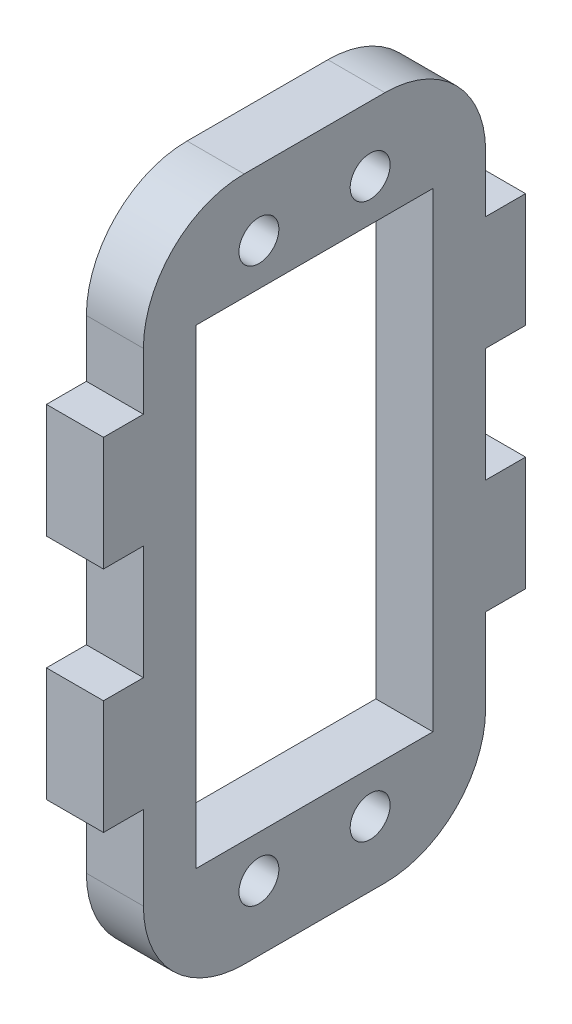
ISO-10303-21;
HEADER;
FILE_DESCRIPTION(('STEP AP214'),'2;1');
FILE_NAME('part.step','',(''),(''),'','','');
FILE_SCHEMA(('AUTOMOTIVE_DESIGN { 1 0 10303 214 1 1 1 1 }'));
ENDSEC;
DATA;
#1=APPLICATION_CONTEXT('core data for automotive mechanical design processes');
#2=APPLICATION_PROTOCOL_DEFINITION('international standard','automotive_design',2000,#1);
#3=PRODUCT_CONTEXT('',#1,'mechanical');
#4=PRODUCT('Part','Part','',(#3));
#5=PRODUCT_RELATED_PRODUCT_CATEGORY('part','',(#4));
#6=PRODUCT_DEFINITION_FORMATION('','',#4);
#7=PRODUCT_DEFINITION_CONTEXT('part definition',#1,'design');
#8=PRODUCT_DEFINITION('design','',#6,#7);
#9=PRODUCT_DEFINITION_SHAPE('','',#8);
#10=(LENGTH_UNIT() NAMED_UNIT(*) SI_UNIT(.MILLI.,.METRE.));
#11=(NAMED_UNIT(*) PLANE_ANGLE_UNIT() SI_UNIT($,.RADIAN.));
#12=(NAMED_UNIT(*) SI_UNIT($,.STERADIAN.) SOLID_ANGLE_UNIT());
#13=UNCERTAINTY_MEASURE_WITH_UNIT(LENGTH_MEASURE(1.E-05),#10,'distance_accuracy_value','');
#14=(GEOMETRIC_REPRESENTATION_CONTEXT(3) GLOBAL_UNCERTAINTY_ASSIGNED_CONTEXT((#13)) GLOBAL_UNIT_ASSIGNED_CONTEXT((#10,
#11,#12)) REPRESENTATION_CONTEXT('',''));
#15=CARTESIAN_POINT('',(0.,0.,0.));
#16=DIRECTION('',(0.,0.,1.));
#17=DIRECTION('',(1.,0.,0.));
#18=AXIS2_PLACEMENT_3D('',#15,#16,#17);
#19=CARTESIAN_POINT('',(0.,0.,0.));
#20=DIRECTION('',(1.,0.,0.));
#21=DIRECTION('',(0.,0.,-1.));
#22=AXIS2_PLACEMENT_3D('',#19,#20,#21);
#23=PLANE('',#22);
#24=DIRECTION('',(0.,1.,0.));
#25=VECTOR('',#24,1.);
#26=CARTESIAN_POINT('',(0.,0.,10.375));
#27=LINE('',#26,#25);
#28=CARTESIAN_POINT('',(0.,-20.625,10.375));
#29=VERTEX_POINT('',#28);
#30=CARTESIAN_POINT('',(0.,20.625,10.375));
#31=VERTEX_POINT('',#30);
#32=EDGE_CURVE('E759',#29,#31,#27,.T.);
#33=ORIENTED_EDGE('',*,*,#32,.F.);
#34=DIRECTION('',(0.,0.,1.));
#35=VECTOR('',#34,1.);
#36=CARTESIAN_POINT('',(0.,-20.625,0.));
#37=LINE('',#36,#35);
#38=CARTESIAN_POINT('',(0.,-20.625,-10.375));
#39=VERTEX_POINT('',#38);
#40=EDGE_CURVE('E765',#39,#29,#37,.T.);
#41=ORIENTED_EDGE('',*,*,#40,.F.);
#42=DIRECTION('',(0.,1.,0.));
#43=VECTOR('',#42,1.);
#44=CARTESIAN_POINT('',(0.,0.,-10.375));
#45=LINE('',#44,#43);
#46=CARTESIAN_POINT('',(0.,20.625,-10.375));
#47=VERTEX_POINT('',#46);
#48=EDGE_CURVE('E767',#39,#47,#45,.T.);
#49=ORIENTED_EDGE('',*,*,#48,.T.);
#50=DIRECTION('',(0.,0.,1.));
#51=VECTOR('',#50,1.);
#52=CARTESIAN_POINT('',(0.,20.625,0.));
#53=LINE('',#52,#51);
#54=EDGE_CURVE('E772',#47,#31,#53,.T.);
#55=ORIENTED_EDGE('',*,*,#54,.T.);
#56=EDGE_LOOP('',(#33,#41,#49,#55));
#57=FACE_BOUND('',#56,.T.);
#58=CARTESIAN_POINT('',(0.,-21.17,-6.17));
#59=DIRECTION('',(1.,0.,0.));
#60=DIRECTION('',(0.,0.,-1.));
#61=AXIS2_PLACEMENT_3D('',#58,#59,#60);
#62=CIRCLE('',#61,8.83);
#63=CARTESIAN_POINT('',(0.,-30.,-6.17));
#64=VERTEX_POINT('',#63);
#65=CARTESIAN_POINT('',(0.,-21.17,-15.));
#66=VERTEX_POINT('',#65);
#67=EDGE_CURVE('E204',#64,#66,#62,.T.);
#68=ORIENTED_EDGE('',*,*,#67,.F.);
#69=DIRECTION('',(0.,0.,1.));
#70=VECTOR('',#69,1.);
#71=CARTESIAN_POINT('',(0.,-30.,0.));
#72=LINE('',#71,#70);
#73=CARTESIAN_POINT('',(0.,-30.,6.16999999999999));
#74=VERTEX_POINT('',#73);
#75=EDGE_CURVE('E199',#64,#74,#72,.T.);
#76=ORIENTED_EDGE('',*,*,#75,.T.);
#77=CARTESIAN_POINT('',(0.,-21.17,6.16999999999999));
#78=DIRECTION('',(-1.,0.,0.));
#79=DIRECTION('',(0.,0.,1.));
#80=AXIS2_PLACEMENT_3D('',#77,#78,#79);
#81=CIRCLE('',#80,8.83);
#82=CARTESIAN_POINT('',(0.,-21.17,15.));
#83=VERTEX_POINT('',#82);
#84=EDGE_CURVE('E365',#83,#74,#81,.F.);
#85=ORIENTED_EDGE('',*,*,#84,.F.);
#86=DIRECTION('',(0.,1.,0.));
#87=VECTOR('',#86,1.);
#88=CARTESIAN_POINT('',(0.,0.,15.));
#89=LINE('',#88,#87);
#90=CARTESIAN_POINT('',(0.,-13.83,15.));
#91=VERTEX_POINT('',#90);
#92=EDGE_CURVE('E234',#83,#91,#89,.T.);
#93=ORIENTED_EDGE('',*,*,#92,.T.);
#94=DIRECTION('',(0.,0.,1.));
#95=VECTOR('',#94,1.);
#96=CARTESIAN_POINT('',(0.,-13.83,0.));
#97=LINE('',#96,#95);
#98=CARTESIAN_POINT('',(0.,-13.83,18.5));
#99=VERTEX_POINT('',#98);
#100=EDGE_CURVE('E241',#91,#99,#97,.T.);
#101=ORIENTED_EDGE('',*,*,#100,.T.);
#102=DIRECTION('',(0.,1.,0.));
#103=VECTOR('',#102,1.);
#104=CARTESIAN_POINT('',(0.,0.,18.5));
#105=LINE('',#104,#103);
#106=CARTESIAN_POINT('',(0.,-3.82999999999997,18.5));
#107=VERTEX_POINT('',#106);
#108=EDGE_CURVE('E247',#107,#99,#105,.F.);
#109=ORIENTED_EDGE('',*,*,#108,.F.);
#110=DIRECTION('',(0.,0.,1.));
#111=VECTOR('',#110,1.);
#112=CARTESIAN_POINT('',(0.,-3.82999999999996,0.));
#113=LINE('',#112,#111);
#114=CARTESIAN_POINT('',(0.,-3.82999999999997,15.));
#115=VERTEX_POINT('',#114);
#116=EDGE_CURVE('E253',#115,#107,#113,.T.);
#117=ORIENTED_EDGE('',*,*,#116,.F.);
#118=DIRECTION('',(0.,1.,0.));
#119=VECTOR('',#118,1.);
#120=CARTESIAN_POINT('',(0.,0.,15.));
#121=LINE('',#120,#119);
#122=CARTESIAN_POINT('',(0.,6.17000000000003,15.));
#123=VERTEX_POINT('',#122);
#124=EDGE_CURVE('E256',#115,#123,#121,.T.);
#125=ORIENTED_EDGE('',*,*,#124,.T.);
#126=DIRECTION('',(0.,0.,-1.));
#127=VECTOR('',#126,1.);
#128=CARTESIAN_POINT('',(0.,6.17000000000001,0.));
#129=LINE('',#128,#127);
#130=CARTESIAN_POINT('',(0.,6.17000000000003,18.5));
#131=VERTEX_POINT('',#130);
#132=EDGE_CURVE('E264',#131,#123,#129,.T.);
#133=ORIENTED_EDGE('',*,*,#132,.F.);
#134=DIRECTION('',(0.,1.,0.));
#135=VECTOR('',#134,1.);
#136=CARTESIAN_POINT('',(0.,0.,18.5));
#137=LINE('',#136,#135);
#138=CARTESIAN_POINT('',(0.,16.17,18.5));
#139=VERTEX_POINT('',#138);
#140=EDGE_CURVE('E267',#131,#139,#137,.T.);
#141=ORIENTED_EDGE('',*,*,#140,.T.);
#142=DIRECTION('',(0.,0.,-1.));
#143=VECTOR('',#142,1.);
#144=CARTESIAN_POINT('',(0.,16.17,0.));
#145=LINE('',#144,#143);
#146=CARTESIAN_POINT('',(0.,16.17,15.));
#147=VERTEX_POINT('',#146);
#148=EDGE_CURVE('E275',#139,#147,#145,.T.);
#149=ORIENTED_EDGE('',*,*,#148,.T.);
#150=DIRECTION('',(0.,1.,0.));
#151=VECTOR('',#150,1.);
#152=CARTESIAN_POINT('',(0.,0.,15.));
#153=LINE('',#152,#151);
#154=CARTESIAN_POINT('',(0.,21.17,15.));
#155=VERTEX_POINT('',#154);
#156=EDGE_CURVE('E281',#147,#155,#153,.T.);
#157=ORIENTED_EDGE('',*,*,#156,.T.);
#158=CARTESIAN_POINT('',(0.,21.17,6.17));
#159=DIRECTION('',(1.,0.,0.));
#160=DIRECTION('',(0.,0.,-1.));
#161=AXIS2_PLACEMENT_3D('',#158,#159,#160);
#162=CIRCLE('',#161,8.83);
#163=CARTESIAN_POINT('',(0.,30.,6.17));
#164=VERTEX_POINT('',#163);
#165=EDGE_CURVE('E284',#164,#155,#162,.T.);
#166=ORIENTED_EDGE('',*,*,#165,.F.);
#167=DIRECTION('',(0.,0.,1.));
#168=VECTOR('',#167,1.);
#169=CARTESIAN_POINT('',(0.,30.,0.));
#170=LINE('',#169,#168);
#171=CARTESIAN_POINT('',(0.,30.,-6.17));
#172=VERTEX_POINT('',#171);
#173=EDGE_CURVE('E287',#172,#164,#170,.T.);
#174=ORIENTED_EDGE('',*,*,#173,.F.);
#175=CARTESIAN_POINT('',(0.,21.17,-6.17));
#176=DIRECTION('',(-1.,0.,0.));
#177=DIRECTION('',(0.,0.,1.));
#178=AXIS2_PLACEMENT_3D('',#175,#176,#177);
#179=CIRCLE('',#178,8.83);
#180=CARTESIAN_POINT('',(0.,21.17,-15.));
#181=VERTEX_POINT('',#180);
#182=EDGE_CURVE('E371',#181,#172,#179,.F.);
#183=ORIENTED_EDGE('',*,*,#182,.F.);
#184=DIRECTION('',(0.,1.,0.));
#185=VECTOR('',#184,1.);
#186=CARTESIAN_POINT('',(0.,0.,-15.));
#187=LINE('',#186,#185);
#188=CARTESIAN_POINT('',(0.,16.17,-15.));
#189=VERTEX_POINT('',#188);
#190=EDGE_CURVE('E291',#189,#181,#187,.T.);
#191=ORIENTED_EDGE('',*,*,#190,.F.);
#192=DIRECTION('',(0.,0.,1.));
#193=VECTOR('',#192,1.);
#194=CARTESIAN_POINT('',(0.,16.17,0.));
#195=LINE('',#194,#193);
#196=CARTESIAN_POINT('',(0.,16.17,-18.5));
#197=VERTEX_POINT('',#196);
#198=EDGE_CURVE('E297',#197,#189,#195,.T.);
#199=ORIENTED_EDGE('',*,*,#198,.F.);
#200=DIRECTION('',(0.,1.,0.));
#201=VECTOR('',#200,1.);
#202=CARTESIAN_POINT('',(0.,0.,-18.5));
#203=LINE('',#202,#201);
#204=CARTESIAN_POINT('',(0.,6.17000000000003,-18.5));
#205=VERTEX_POINT('',#204);
#206=EDGE_CURVE('E303',#205,#197,#203,.T.);
#207=ORIENTED_EDGE('',*,*,#206,.F.);
#208=DIRECTION('',(0.,0.,1.));
#209=VECTOR('',#208,1.);
#210=CARTESIAN_POINT('',(0.,6.17000000000001,0.));
#211=LINE('',#210,#209);
#212=CARTESIAN_POINT('',(0.,6.17000000000002,-15.));
#213=VERTEX_POINT('',#212);
#214=EDGE_CURVE('E306',#205,#213,#211,.T.);
#215=ORIENTED_EDGE('',*,*,#214,.T.);
#216=DIRECTION('',(0.,1.,0.));
#217=VECTOR('',#216,1.);
#218=CARTESIAN_POINT('',(0.,0.,-15.));
#219=LINE('',#218,#217);
#220=CARTESIAN_POINT('',(0.,-3.82999999999996,-15.));
#221=VERTEX_POINT('',#220);
#222=EDGE_CURVE('E314',#221,#213,#219,.T.);
#223=ORIENTED_EDGE('',*,*,#222,.F.);
#224=DIRECTION('',(0.,0.,-1.));
#225=VECTOR('',#224,1.);
#226=CARTESIAN_POINT('',(0.,-3.82999999999996,0.));
#227=LINE('',#226,#225);
#228=CARTESIAN_POINT('',(0.,-3.82999999999996,-18.5));
#229=VERTEX_POINT('',#228);
#230=EDGE_CURVE('E317',#221,#229,#227,.T.);
#231=ORIENTED_EDGE('',*,*,#230,.T.);
#232=DIRECTION('',(0.,1.,0.));
#233=VECTOR('',#232,1.);
#234=CARTESIAN_POINT('',(0.,0.,-18.5));
#235=LINE('',#234,#233);
#236=CARTESIAN_POINT('',(0.,-13.83,-18.5));
#237=VERTEX_POINT('',#236);
#238=EDGE_CURVE('E325',#229,#237,#235,.F.);
#239=ORIENTED_EDGE('',*,*,#238,.T.);
#240=DIRECTION('',(0.,0.,-1.));
#241=VECTOR('',#240,1.);
#242=CARTESIAN_POINT('',(0.,-13.83,0.));
#243=LINE('',#242,#241);
#244=CARTESIAN_POINT('',(0.,-13.83,-15.));
#245=VERTEX_POINT('',#244);
#246=EDGE_CURVE('E218',#245,#237,#243,.T.);
#247=ORIENTED_EDGE('',*,*,#246,.F.);
#248=DIRECTION('',(0.,1.,0.));
#249=VECTOR('',#248,1.);
#250=CARTESIAN_POINT('',(0.,0.,-15.));
#251=LINE('',#250,#249);
#252=EDGE_CURVE('E215',#66,#245,#251,.T.);
#253=ORIENTED_EDGE('',*,*,#252,.F.);
#254=EDGE_LOOP('',(#68,#76,#85,#93,#101,#109,#117,#125,#133,#141,#149,#157,#166,#174,#183,#191,
#199,#207,#215,#223,#231,#239,#247,#253));
#255=FACE_BOUND('',#254,.T.);
#256=CARTESIAN_POINT('',(0.,24.3,4.875));
#257=DIRECTION('',(-1.,0.,0.));
#258=DIRECTION('',(0.,0.,1.));
#259=AXIS2_PLACEMENT_3D('',#256,#257,#258);
#260=CIRCLE('',#259,1.75);
#261=CARTESIAN_POINT('',(0.,24.3,6.625));
#262=VERTEX_POINT('',#261);
#263=EDGE_CURVE('E233',#262,#262,#260,.F.);
#264=ORIENTED_EDGE('',*,*,#263,.T.);
#265=EDGE_LOOP('',(#264));
#266=FACE_BOUND('',#265,.T.);
#267=CARTESIAN_POINT('',(0.,24.3,-4.875));
#268=DIRECTION('',(-1.,0.,0.));
#269=DIRECTION('',(0.,0.,1.));
#270=AXIS2_PLACEMENT_3D('',#267,#268,#269);
#271=CIRCLE('',#270,1.75);
#272=CARTESIAN_POINT('',(0.,24.3,-3.125));
#273=VERTEX_POINT('',#272);
#274=EDGE_CURVE('E376',#273,#273,#271,.F.);
#275=ORIENTED_EDGE('',*,*,#274,.T.);
#276=EDGE_LOOP('',(#275));
#277=FACE_BOUND('',#276,.T.);
#278=CARTESIAN_POINT('',(0.,-24.3,4.87499999999999));
#279=DIRECTION('',(-1.,0.,0.));
#280=DIRECTION('',(0.,0.,1.));
#281=AXIS2_PLACEMENT_3D('',#278,#279,#280);
#282=CIRCLE('',#281,1.75);
#283=CARTESIAN_POINT('',(0.,-24.3,6.625));
#284=VERTEX_POINT('',#283);
#285=EDGE_CURVE('E378',#284,#284,#282,.F.);
#286=ORIENTED_EDGE('',*,*,#285,.T.);
#287=EDGE_LOOP('',(#286));
#288=FACE_BOUND('',#287,.T.);
#289=CARTESIAN_POINT('',(0.,-24.3,-4.87500000000001));
#290=DIRECTION('',(-1.,0.,0.));
#291=DIRECTION('',(0.,0.,1.));
#292=AXIS2_PLACEMENT_3D('',#289,#290,#291);
#293=CIRCLE('',#292,1.75);
#294=CARTESIAN_POINT('',(0.,-24.3,-3.125));
#295=VERTEX_POINT('',#294);
#296=EDGE_CURVE('E20',#295,#295,#293,.F.);
#297=ORIENTED_EDGE('',*,*,#296,.T.);
#298=EDGE_LOOP('',(#297));
#299=FACE_BOUND('',#298,.T.);
#300=ADVANCED_FACE('F17',(#57,#255,#266,#277,#288,#299),#23,.F.);
#301=CARTESIAN_POINT('',(5.,-24.3,-4.87500000000001));
#302=DIRECTION('',(-1.,0.,0.));
#303=DIRECTION('',(0.,0.,1.));
#304=AXIS2_PLACEMENT_3D('',#301,#302,#303);
#305=CYLINDRICAL_SURFACE('',#304,1.75);
#306=CARTESIAN_POINT('',(5.,-24.3,-4.87500000000001));
#307=DIRECTION('',(-1.,0.,0.));
#308=DIRECTION('',(0.,0.,1.));
#309=AXIS2_PLACEMENT_3D('',#306,#307,#308);
#310=CIRCLE('',#309,1.75);
#311=CARTESIAN_POINT('',(5.,-24.3,-3.125));
#312=VERTEX_POINT('',#311);
#313=EDGE_CURVE('E362',#312,#312,#310,.T.);
#314=ORIENTED_EDGE('',*,*,#313,.F.);
#315=EDGE_LOOP('',(#314));
#316=FACE_BOUND('',#315,.T.);
#317=ORIENTED_EDGE('',*,*,#296,.F.);
#318=EDGE_LOOP('',(#317));
#319=FACE_BOUND('',#318,.T.);
#320=ADVANCED_FACE('F386',(#316,#319),#305,.F.);
#321=CARTESIAN_POINT('',(5.,-24.3,4.87499999999999));
#322=DIRECTION('',(-1.,0.,0.));
#323=DIRECTION('',(0.,0.,1.));
#324=AXIS2_PLACEMENT_3D('',#321,#322,#323);
#325=CYLINDRICAL_SURFACE('',#324,1.75);
#326=CARTESIAN_POINT('',(5.,-24.3,4.87499999999999));
#327=DIRECTION('',(-1.,0.,0.));
#328=DIRECTION('',(0.,0.,1.));
#329=AXIS2_PLACEMENT_3D('',#326,#327,#328);
#330=CIRCLE('',#329,1.75);
#331=CARTESIAN_POINT('',(5.,-24.3,6.625));
#332=VERTEX_POINT('',#331);
#333=EDGE_CURVE('E359',#332,#332,#330,.T.);
#334=ORIENTED_EDGE('',*,*,#333,.F.);
#335=EDGE_LOOP('',(#334));
#336=FACE_BOUND('',#335,.T.);
#337=ORIENTED_EDGE('',*,*,#285,.F.);
#338=EDGE_LOOP('',(#337));
#339=FACE_BOUND('',#338,.T.);
#340=ADVANCED_FACE('F388',(#336,#339),#325,.F.);
#341=CARTESIAN_POINT('',(5.,24.3,-4.875));
#342=DIRECTION('',(-1.,0.,0.));
#343=DIRECTION('',(0.,0.,1.));
#344=AXIS2_PLACEMENT_3D('',#341,#342,#343);
#345=CYLINDRICAL_SURFACE('',#344,1.75);
#346=CARTESIAN_POINT('',(5.,24.3,-4.875));
#347=DIRECTION('',(-1.,0.,0.));
#348=DIRECTION('',(0.,0.,1.));
#349=AXIS2_PLACEMENT_3D('',#346,#347,#348);
#350=CIRCLE('',#349,1.75);
#351=CARTESIAN_POINT('',(5.,24.3,-3.125));
#352=VERTEX_POINT('',#351);
#353=EDGE_CURVE('E356',#352,#352,#350,.T.);
#354=ORIENTED_EDGE('',*,*,#353,.F.);
#355=EDGE_LOOP('',(#354));
#356=FACE_BOUND('',#355,.T.);
#357=ORIENTED_EDGE('',*,*,#274,.F.);
#358=EDGE_LOOP('',(#357));
#359=FACE_BOUND('',#358,.T.);
#360=ADVANCED_FACE('F395',(#356,#359),#345,.F.);
#361=CARTESIAN_POINT('',(5.,24.3,4.875));
#362=DIRECTION('',(-1.,0.,0.));
#363=DIRECTION('',(0.,0.,1.));
#364=AXIS2_PLACEMENT_3D('',#361,#362,#363);
#365=CYLINDRICAL_SURFACE('',#364,1.75);
#366=CARTESIAN_POINT('',(5.,24.3,4.875));
#367=DIRECTION('',(-1.,0.,0.));
#368=DIRECTION('',(0.,0.,1.));
#369=AXIS2_PLACEMENT_3D('',#366,#367,#368);
#370=CIRCLE('',#369,1.75);
#371=CARTESIAN_POINT('',(5.,24.3,6.625));
#372=VERTEX_POINT('',#371);
#373=EDGE_CURVE('E353',#372,#372,#370,.T.);
#374=ORIENTED_EDGE('',*,*,#373,.F.);
#375=EDGE_LOOP('',(#374));
#376=FACE_BOUND('',#375,.T.);
#377=ORIENTED_EDGE('',*,*,#263,.F.);
#378=EDGE_LOOP('',(#377));
#379=FACE_BOUND('',#378,.T.);
#380=ADVANCED_FACE('F515',(#376,#379),#365,.F.);
#381=CARTESIAN_POINT('',(5.,-30.,0.));
#382=DIRECTION('',(0.,1.,0.));
#383=DIRECTION('',(0.,0.,1.));
#384=AXIS2_PLACEMENT_3D('',#381,#382,#383);
#385=PLANE('',#384);
#386=DIRECTION('',(1.,0.,0.));
#387=VECTOR('',#386,1.);
#388=CARTESIAN_POINT('',(5.,-30.,-6.17));
#389=LINE('',#388,#387);
#390=CARTESIAN_POINT('',(5.,-30.,-6.17));
#391=VERTEX_POINT('',#390);
#392=EDGE_CURVE('E211',#391,#64,#389,.F.);
#393=ORIENTED_EDGE('',*,*,#392,.F.);
#394=DIRECTION('',(0.,0.,-1.));
#395=VECTOR('',#394,1.);
#396=CARTESIAN_POINT('',(5.,-30.,0.));
#397=LINE('',#396,#395);
#398=CARTESIAN_POINT('',(5.,-30.,6.16999999999999));
#399=VERTEX_POINT('',#398);
#400=EDGE_CURVE('E352',#399,#391,#397,.T.);
#401=ORIENTED_EDGE('',*,*,#400,.F.);
#402=DIRECTION('',(-1.,0.,0.));
#403=VECTOR('',#402,1.);
#404=CARTESIAN_POINT('',(5.,-30.,6.16999999999999));
#405=LINE('',#404,#403);
#406=EDGE_CURVE('E368',#74,#399,#405,.F.);
#407=ORIENTED_EDGE('',*,*,#406,.F.);
#408=ORIENTED_EDGE('',*,*,#75,.F.);
#409=EDGE_LOOP('',(#393,#401,#407,#408));
#410=FACE_BOUND('',#409,.T.);
#411=ADVANCED_FACE('F512',(#410),#385,.F.);
#412=CARTESIAN_POINT('',(5.,-21.17,-6.17));
#413=DIRECTION('',(1.,0.,0.));
#414=DIRECTION('',(0.,0.,-1.));
#415=AXIS2_PLACEMENT_3D('',#412,#413,#414);
#416=CYLINDRICAL_SURFACE('',#415,8.83);
#417=ORIENTED_EDGE('',*,*,#67,.T.);
#418=DIRECTION('',(1.,0.,0.));
#419=VECTOR('',#418,1.);
#420=CARTESIAN_POINT('',(5.,-21.17,-15.));
#421=LINE('',#420,#419);
#422=CARTESIAN_POINT('',(5.,-21.17,-15.));
#423=VERTEX_POINT('',#422);
#424=EDGE_CURVE('E209',#423,#66,#421,.F.);
#425=ORIENTED_EDGE('',*,*,#424,.F.);
#426=CARTESIAN_POINT('',(5.,-21.17,-6.17));
#427=DIRECTION('',(1.,0.,0.));
#428=DIRECTION('',(0.,0.,-1.));
#429=AXIS2_PLACEMENT_3D('',#426,#427,#428);
#430=CIRCLE('',#429,8.83);
#431=EDGE_CURVE('E350',#391,#423,#430,.T.);
#432=ORIENTED_EDGE('',*,*,#431,.F.);
#433=ORIENTED_EDGE('',*,*,#392,.T.);
#434=EDGE_LOOP('',(#417,#425,#432,#433));
#435=FACE_BOUND('',#434,.T.);
#436=ADVANCED_FACE('F206',(#435),#416,.T.);
#437=CARTESIAN_POINT('',(5.,0.,-15.));
#438=DIRECTION('',(0.,0.,-1.));
#439=DIRECTION('',(0.,1.,0.));
#440=AXIS2_PLACEMENT_3D('',#437,#438,#439);
#441=PLANE('',#440);
#442=ORIENTED_EDGE('',*,*,#252,.T.);
#443=DIRECTION('',(1.,0.,0.));
#444=VECTOR('',#443,1.);
#445=CARTESIAN_POINT('',(5.,-13.83,-15.));
#446=LINE('',#445,#444);
#447=CARTESIAN_POINT('',(5.,-13.83,-15.));
#448=VERTEX_POINT('',#447);
#449=EDGE_CURVE('E331',#448,#245,#446,.F.);
#450=ORIENTED_EDGE('',*,*,#449,.F.);
#451=DIRECTION('',(0.,1.,0.));
#452=VECTOR('',#451,1.);
#453=CARTESIAN_POINT('',(5.,0.,-15.));
#454=LINE('',#453,#452);
#455=EDGE_CURVE('E224',#423,#448,#454,.T.);
#456=ORIENTED_EDGE('',*,*,#455,.F.);
#457=ORIENTED_EDGE('',*,*,#424,.T.);
#458=EDGE_LOOP('',(#442,#450,#456,#457));
#459=FACE_BOUND('',#458,.T.);
#460=ADVANCED_FACE('F222',(#459),#441,.T.);
#461=CARTESIAN_POINT('',(5.,-13.83,0.));
#462=DIRECTION('',(0.,-1.,0.));
#463=DIRECTION('',(0.,0.,-1.));
#464=AXIS2_PLACEMENT_3D('',#461,#462,#463);
#465=PLANE('',#464);
#466=DIRECTION('',(0.,0.,-1.));
#467=VECTOR('',#466,1.);
#468=CARTESIAN_POINT('',(5.,-13.83,0.));
#469=LINE('',#468,#467);
#470=CARTESIAN_POINT('',(5.,-13.83,-18.5));
#471=VERTEX_POINT('',#470);
#472=EDGE_CURVE('E896',#448,#471,#469,.T.);
#473=ORIENTED_EDGE('',*,*,#472,.F.);
#474=ORIENTED_EDGE('',*,*,#449,.T.);
#475=ORIENTED_EDGE('',*,*,#246,.T.);
#476=DIRECTION('',(1.,0.,0.));
#477=VECTOR('',#476,1.);
#478=CARTESIAN_POINT('',(5.,-13.83,-18.5));
#479=LINE('',#478,#477);
#480=EDGE_CURVE('E327',#237,#471,#479,.T.);
#481=ORIENTED_EDGE('',*,*,#480,.T.);
#482=EDGE_LOOP('',(#473,#474,#475,#481));
#483=FACE_BOUND('',#482,.T.);
#484=ADVANCED_FACE('F503',(#483),#465,.T.);
#485=CARTESIAN_POINT('',(5.,0.,-18.5));
#486=DIRECTION('',(0.,0.,1.));
#487=DIRECTION('',(1.,0.,0.));
#488=AXIS2_PLACEMENT_3D('',#485,#486,#487);
#489=PLANE('',#488);
#490=DIRECTION('',(1.,0.,0.));
#491=VECTOR('',#490,1.);
#492=CARTESIAN_POINT('',(5.,-3.82999999999996,-18.5));
#493=LINE('',#492,#491);
#494=CARTESIAN_POINT('',(5.,-3.82999999999996,-18.5));
#495=VERTEX_POINT('',#494);
#496=EDGE_CURVE('E322',#229,#495,#493,.T.);
#497=ORIENTED_EDGE('',*,*,#496,.T.);
#498=DIRECTION('',(0.,1.,0.));
#499=VECTOR('',#498,1.);
#500=CARTESIAN_POINT('',(5.,0.,-18.5));
#501=LINE('',#500,#499);
#502=EDGE_CURVE('E888',#471,#495,#501,.T.);
#503=ORIENTED_EDGE('',*,*,#502,.F.);
#504=ORIENTED_EDGE('',*,*,#480,.F.);
#505=ORIENTED_EDGE('',*,*,#238,.F.);
#506=EDGE_LOOP('',(#497,#503,#504,#505));
#507=FACE_BOUND('',#506,.T.);
#508=ADVANCED_FACE('F499',(#507),#489,.F.);
#509=CARTESIAN_POINT('',(5.,-3.82999999999996,0.));
#510=DIRECTION('',(0.,-1.,0.));
#511=DIRECTION('',(0.,0.,-1.));
#512=AXIS2_PLACEMENT_3D('',#509,#510,#511);
#513=PLANE('',#512);
#514=DIRECTION('',(1.,0.,0.));
#515=VECTOR('',#514,1.);
#516=CARTESIAN_POINT('',(5.,-3.82999999999996,-15.));
#517=LINE('',#516,#515);
#518=CARTESIAN_POINT('',(5.,-3.82999999999996,-15.));
#519=VERTEX_POINT('',#518);
#520=EDGE_CURVE('E316',#519,#221,#517,.F.);
#521=ORIENTED_EDGE('',*,*,#520,.F.);
#522=DIRECTION('',(0.,0.,-1.));
#523=VECTOR('',#522,1.);
#524=CARTESIAN_POINT('',(5.,-3.82999999999996,0.));
#525=LINE('',#524,#523);
#526=EDGE_CURVE('E879',#495,#519,#525,.F.);
#527=ORIENTED_EDGE('',*,*,#526,.F.);
#528=ORIENTED_EDGE('',*,*,#496,.F.);
#529=ORIENTED_EDGE('',*,*,#230,.F.);
#530=EDGE_LOOP('',(#521,#527,#528,#529));
#531=FACE_BOUND('',#530,.T.);
#532=ADVANCED_FACE('F495',(#531),#513,.F.);
#533=CARTESIAN_POINT('',(5.,0.,-15.));
#534=DIRECTION('',(0.,0.,-1.));
#535=DIRECTION('',(0.,1.,0.));
#536=AXIS2_PLACEMENT_3D('',#533,#534,#535);
#537=PLANE('',#536);
#538=DIRECTION('',(0.,1.,0.));
#539=VECTOR('',#538,1.);
#540=CARTESIAN_POINT('',(5.,0.,-15.));
#541=LINE('',#540,#539);
#542=CARTESIAN_POINT('',(5.,6.17000000000003,-15.));
#543=VERTEX_POINT('',#542);
#544=EDGE_CURVE('E871',#519,#543,#541,.T.);
#545=ORIENTED_EDGE('',*,*,#544,.F.);
#546=ORIENTED_EDGE('',*,*,#520,.T.);
#547=ORIENTED_EDGE('',*,*,#222,.T.);
#548=DIRECTION('',(1.,0.,0.));
#549=VECTOR('',#548,1.);
#550=CARTESIAN_POINT('',(5.,6.17000000000002,-15.));
#551=LINE('',#550,#549);
#552=EDGE_CURVE('E311',#213,#543,#551,.T.);
#553=ORIENTED_EDGE('',*,*,#552,.T.);
#554=EDGE_LOOP('',(#545,#546,#547,#553));
#555=FACE_BOUND('',#554,.T.);
#556=ADVANCED_FACE('F491',(#555),#537,.T.);
#557=CARTESIAN_POINT('',(5.,6.17000000000001,0.));
#558=DIRECTION('',(0.,1.,0.));
#559=DIRECTION('',(0.,0.,1.));
#560=AXIS2_PLACEMENT_3D('',#557,#558,#559);
#561=PLANE('',#560);
#562=DIRECTION('',(-1.,0.,0.));
#563=VECTOR('',#562,1.);
#564=CARTESIAN_POINT('',(5.,6.17000000000003,-18.5));
#565=LINE('',#564,#563);
#566=CARTESIAN_POINT('',(5.,6.17000000000003,-18.5));
#567=VERTEX_POINT('',#566);
#568=EDGE_CURVE('E300',#567,#205,#565,.T.);
#569=ORIENTED_EDGE('',*,*,#568,.F.);
#570=DIRECTION('',(0.,0.,-1.));
#571=VECTOR('',#570,1.);
#572=CARTESIAN_POINT('',(5.,6.17000000000003,0.));
#573=LINE('',#572,#571);
#574=EDGE_CURVE('E862',#543,#567,#573,.T.);
#575=ORIENTED_EDGE('',*,*,#574,.F.);
#576=ORIENTED_EDGE('',*,*,#552,.F.);
#577=ORIENTED_EDGE('',*,*,#214,.F.);
#578=EDGE_LOOP('',(#569,#575,#576,#577));
#579=FACE_BOUND('',#578,.T.);
#580=ADVANCED_FACE('F487',(#579),#561,.F.);
#581=CARTESIAN_POINT('',(5.,0.,-18.5));
#582=DIRECTION('',(0.,0.,-1.));
#583=DIRECTION('',(-1.,0.,0.));
#584=AXIS2_PLACEMENT_3D('',#581,#582,#583);
#585=PLANE('',#584);
#586=DIRECTION('',(0.,1.,0.));
#587=VECTOR('',#586,1.);
#588=CARTESIAN_POINT('',(5.,0.,-18.5));
#589=LINE('',#588,#587);
#590=CARTESIAN_POINT('',(5.,16.17,-18.5));
#591=VERTEX_POINT('',#590);
#592=EDGE_CURVE('E853',#567,#591,#589,.T.);
#593=ORIENTED_EDGE('',*,*,#592,.F.);
#594=ORIENTED_EDGE('',*,*,#568,.T.);
#595=ORIENTED_EDGE('',*,*,#206,.T.);
#596=DIRECTION('',(1.,0.,0.));
#597=VECTOR('',#596,1.);
#598=CARTESIAN_POINT('',(5.,16.17,-18.5));
#599=LINE('',#598,#597);
#600=EDGE_CURVE('E294',#591,#197,#599,.F.);
#601=ORIENTED_EDGE('',*,*,#600,.F.);
#602=EDGE_LOOP('',(#593,#594,#595,#601));
#603=FACE_BOUND('',#602,.T.);
#604=ADVANCED_FACE('F483',(#603),#585,.T.);
#605=CARTESIAN_POINT('',(5.,16.17,0.));
#606=DIRECTION('',(0.,1.,0.));
#607=DIRECTION('',(0.,0.,1.));
#608=AXIS2_PLACEMENT_3D('',#605,#606,#607);
#609=PLANE('',#608);
#610=DIRECTION('',(0.,0.,-1.));
#611=VECTOR('',#610,1.);
#612=CARTESIAN_POINT('',(5.,16.17,0.));
#613=LINE('',#612,#611);
#614=CARTESIAN_POINT('',(5.,16.17,-15.));
#615=VERTEX_POINT('',#614);
#616=EDGE_CURVE('E850',#591,#615,#613,.F.);
#617=ORIENTED_EDGE('',*,*,#616,.F.);
#618=ORIENTED_EDGE('',*,*,#600,.T.);
#619=ORIENTED_EDGE('',*,*,#198,.T.);
#620=DIRECTION('',(1.,0.,0.));
#621=VECTOR('',#620,1.);
#622=CARTESIAN_POINT('',(5.,16.17,-15.));
#623=LINE('',#622,#621);
#624=EDGE_CURVE('E293',#615,#189,#623,.F.);
#625=ORIENTED_EDGE('',*,*,#624,.F.);
#626=EDGE_LOOP('',(#617,#618,#619,#625));
#627=FACE_BOUND('',#626,.T.);
#628=ADVANCED_FACE('F479',(#627),#609,.T.);
#629=CARTESIAN_POINT('',(5.,0.,-15.));
#630=DIRECTION('',(0.,0.,-1.));
#631=DIRECTION('',(0.,1.,0.));
#632=AXIS2_PLACEMENT_3D('',#629,#630,#631);
#633=PLANE('',#632);
#634=DIRECTION('',(0.,1.,0.));
#635=VECTOR('',#634,1.);
#636=CARTESIAN_POINT('',(5.,0.,-15.));
#637=LINE('',#636,#635);
#638=CARTESIAN_POINT('',(5.,21.17,-15.));
#639=VERTEX_POINT('',#638);
#640=EDGE_CURVE('E349',#615,#639,#637,.T.);
#641=ORIENTED_EDGE('',*,*,#640,.F.);
#642=ORIENTED_EDGE('',*,*,#624,.T.);
#643=ORIENTED_EDGE('',*,*,#190,.T.);
#644=DIRECTION('',(-1.,0.,0.));
#645=VECTOR('',#644,1.);
#646=CARTESIAN_POINT('',(5.,21.17,-15.));
#647=LINE('',#646,#645);
#648=EDGE_CURVE('E372',#639,#181,#647,.T.);
#649=ORIENTED_EDGE('',*,*,#648,.F.);
#650=EDGE_LOOP('',(#641,#642,#643,#649));
#651=FACE_BOUND('',#650,.T.);
#652=ADVANCED_FACE('F475',(#651),#633,.T.);
#653=CARTESIAN_POINT('',(5.,21.17,-6.17));
#654=DIRECTION('',(-1.,0.,0.));
#655=DIRECTION('',(0.,0.,1.));
#656=AXIS2_PLACEMENT_3D('',#653,#654,#655);
#657=CYLINDRICAL_SURFACE('',#656,8.83);
#658=ORIENTED_EDGE('',*,*,#182,.T.);
#659=DIRECTION('',(1.,0.,0.));
#660=VECTOR('',#659,1.);
#661=CARTESIAN_POINT('',(5.,30.,-6.17));
#662=LINE('',#661,#660);
#663=CARTESIAN_POINT('',(5.,30.,-6.17));
#664=VERTEX_POINT('',#663);
#665=EDGE_CURVE('E290',#664,#172,#662,.F.);
#666=ORIENTED_EDGE('',*,*,#665,.F.);
#667=CARTESIAN_POINT('',(5.,21.17,-6.17));
#668=DIRECTION('',(-1.,0.,0.));
#669=DIRECTION('',(0.,0.,1.));
#670=AXIS2_PLACEMENT_3D('',#667,#668,#669);
#671=CIRCLE('',#670,8.83);
#672=EDGE_CURVE('E346',#639,#664,#671,.F.);
#673=ORIENTED_EDGE('',*,*,#672,.F.);
#674=ORIENTED_EDGE('',*,*,#648,.T.);
#675=EDGE_LOOP('',(#658,#666,#673,#674));
#676=FACE_BOUND('',#675,.T.);
#677=ADVANCED_FACE('F471',(#676),#657,.T.);
#678=CARTESIAN_POINT('',(5.,30.,0.));
#679=DIRECTION('',(0.,1.,0.));
#680=DIRECTION('',(0.,0.,1.));
#681=AXIS2_PLACEMENT_3D('',#678,#679,#680);
#682=PLANE('',#681);
#683=ORIENTED_EDGE('',*,*,#173,.T.);
#684=DIRECTION('',(1.,0.,0.));
#685=VECTOR('',#684,1.);
#686=CARTESIAN_POINT('',(5.,30.,6.17));
#687=LINE('',#686,#685);
#688=CARTESIAN_POINT('',(5.,30.,6.17));
#689=VERTEX_POINT('',#688);
#690=EDGE_CURVE('E289',#689,#164,#687,.F.);
#691=ORIENTED_EDGE('',*,*,#690,.F.);
#692=DIRECTION('',(0.,0.,-1.));
#693=VECTOR('',#692,1.);
#694=CARTESIAN_POINT('',(5.,30.,0.));
#695=LINE('',#694,#693);
#696=EDGE_CURVE('E345',#664,#689,#695,.F.);
#697=ORIENTED_EDGE('',*,*,#696,.F.);
#698=ORIENTED_EDGE('',*,*,#665,.T.);
#699=EDGE_LOOP('',(#683,#691,#697,#698));
#700=FACE_BOUND('',#699,.T.);
#701=ADVANCED_FACE('F467',(#700),#682,.T.);
#702=CARTESIAN_POINT('',(5.,21.17,6.17));
#703=DIRECTION('',(1.,0.,0.));
#704=DIRECTION('',(0.,0.,-1.));
#705=AXIS2_PLACEMENT_3D('',#702,#703,#704);
#706=CYLINDRICAL_SURFACE('',#705,8.83);
#707=ORIENTED_EDGE('',*,*,#165,.T.);
#708=DIRECTION('',(1.,0.,0.));
#709=VECTOR('',#708,1.);
#710=CARTESIAN_POINT('',(5.,21.17,15.));
#711=LINE('',#710,#709);
#712=CARTESIAN_POINT('',(5.,21.17,15.));
#713=VERTEX_POINT('',#712);
#714=EDGE_CURVE('E283',#155,#713,#711,.T.);
#715=ORIENTED_EDGE('',*,*,#714,.T.);
#716=CARTESIAN_POINT('',(5.,21.17,6.17));
#717=DIRECTION('',(1.,0.,0.));
#718=DIRECTION('',(0.,0.,-1.));
#719=AXIS2_PLACEMENT_3D('',#716,#717,#718);
#720=CIRCLE('',#719,8.83);
#721=EDGE_CURVE('E341',#689,#713,#720,.T.);
#722=ORIENTED_EDGE('',*,*,#721,.F.);
#723=ORIENTED_EDGE('',*,*,#690,.T.);
#724=EDGE_LOOP('',(#707,#715,#722,#723));
#725=FACE_BOUND('',#724,.T.);
#726=ADVANCED_FACE('F463',(#725),#706,.T.);
#727=CARTESIAN_POINT('',(5.,0.,15.));
#728=DIRECTION('',(0.,0.,-1.));
#729=DIRECTION('',(0.,1.,0.));
#730=AXIS2_PLACEMENT_3D('',#727,#728,#729);
#731=PLANE('',#730);
#732=ORIENTED_EDGE('',*,*,#714,.F.);
#733=ORIENTED_EDGE('',*,*,#156,.F.);
#734=DIRECTION('',(1.,0.,0.));
#735=VECTOR('',#734,1.);
#736=CARTESIAN_POINT('',(5.,16.17,15.));
#737=LINE('',#736,#735);
#738=CARTESIAN_POINT('',(5.,16.17,15.));
#739=VERTEX_POINT('',#738);
#740=EDGE_CURVE('E278',#147,#739,#737,.T.);
#741=ORIENTED_EDGE('',*,*,#740,.T.);
#742=DIRECTION('',(0.,1.,0.));
#743=VECTOR('',#742,1.);
#744=CARTESIAN_POINT('',(5.,0.,15.));
#745=LINE('',#744,#743);
#746=EDGE_CURVE('E344',#713,#739,#745,.F.);
#747=ORIENTED_EDGE('',*,*,#746,.F.);
#748=EDGE_LOOP('',(#732,#733,#741,#747));
#749=FACE_BOUND('',#748,.T.);
#750=ADVANCED_FACE('F459',(#749),#731,.F.);
#751=CARTESIAN_POINT('',(5.,16.17,0.));
#752=DIRECTION('',(0.,-1.,0.));
#753=DIRECTION('',(0.,0.,-1.));
#754=AXIS2_PLACEMENT_3D('',#751,#752,#753);
#755=PLANE('',#754);
#756=DIRECTION('',(-1.,0.,0.));
#757=VECTOR('',#756,1.);
#758=CARTESIAN_POINT('',(5.,16.17,18.5));
#759=LINE('',#758,#757);
#760=CARTESIAN_POINT('',(5.,16.17,18.5));
#761=VERTEX_POINT('',#760);
#762=EDGE_CURVE('E272',#139,#761,#759,.F.);
#763=ORIENTED_EDGE('',*,*,#762,.T.);
#764=DIRECTION('',(0.,0.,-1.));
#765=VECTOR('',#764,1.);
#766=CARTESIAN_POINT('',(5.,16.17,0.));
#767=LINE('',#766,#765);
#768=EDGE_CURVE('E826',#739,#761,#767,.F.);
#769=ORIENTED_EDGE('',*,*,#768,.F.);
#770=ORIENTED_EDGE('',*,*,#740,.F.);
#771=ORIENTED_EDGE('',*,*,#148,.F.);
#772=EDGE_LOOP('',(#763,#769,#770,#771));
#773=FACE_BOUND('',#772,.T.);
#774=ADVANCED_FACE('F455',(#773),#755,.F.);
#775=CARTESIAN_POINT('',(5.,0.,18.5));
#776=DIRECTION('',(0.,0.,-1.));
#777=DIRECTION('',(-1.,0.,0.));
#778=AXIS2_PLACEMENT_3D('',#775,#776,#777);
#779=PLANE('',#778);
#780=DIRECTION('',(1.,0.,0.));
#781=VECTOR('',#780,1.);
#782=CARTESIAN_POINT('',(5.,6.17000000000003,18.5));
#783=LINE('',#782,#781);
#784=CARTESIAN_POINT('',(5.,6.17000000000003,18.5));
#785=VERTEX_POINT('',#784);
#786=EDGE_CURVE('E266',#785,#131,#783,.F.);
#787=ORIENTED_EDGE('',*,*,#786,.F.);
#788=DIRECTION('',(0.,1.,0.));
#789=VECTOR('',#788,1.);
#790=CARTESIAN_POINT('',(5.,0.,18.5));
#791=LINE('',#790,#789);
#792=EDGE_CURVE('E817',#761,#785,#791,.F.);
#793=ORIENTED_EDGE('',*,*,#792,.F.);
#794=ORIENTED_EDGE('',*,*,#762,.F.);
#795=ORIENTED_EDGE('',*,*,#140,.F.);
#796=EDGE_LOOP('',(#787,#793,#794,#795));
#797=FACE_BOUND('',#796,.T.);
#798=ADVANCED_FACE('F451',(#797),#779,.F.);
#799=CARTESIAN_POINT('',(5.,6.17000000000001,0.));
#800=DIRECTION('',(0.,-1.,0.));
#801=DIRECTION('',(0.,0.,-1.));
#802=AXIS2_PLACEMENT_3D('',#799,#800,#801);
#803=PLANE('',#802);
#804=DIRECTION('',(0.,0.,-1.));
#805=VECTOR('',#804,1.);
#806=CARTESIAN_POINT('',(5.,6.17000000000003,0.));
#807=LINE('',#806,#805);
#808=CARTESIAN_POINT('',(5.,6.17000000000003,15.));
#809=VERTEX_POINT('',#808);
#810=EDGE_CURVE('E809',#785,#809,#807,.T.);
#811=ORIENTED_EDGE('',*,*,#810,.F.);
#812=ORIENTED_EDGE('',*,*,#786,.T.);
#813=ORIENTED_EDGE('',*,*,#132,.T.);
#814=DIRECTION('',(1.,0.,0.));
#815=VECTOR('',#814,1.);
#816=CARTESIAN_POINT('',(5.,6.17000000000003,15.));
#817=LINE('',#816,#815);
#818=EDGE_CURVE('E261',#123,#809,#817,.T.);
#819=ORIENTED_EDGE('',*,*,#818,.T.);
#820=EDGE_LOOP('',(#811,#812,#813,#819));
#821=FACE_BOUND('',#820,.T.);
#822=ADVANCED_FACE('F447',(#821),#803,.T.);
#823=CARTESIAN_POINT('',(5.,0.,15.));
#824=DIRECTION('',(0.,0.,-1.));
#825=DIRECTION('',(0.,1.,0.));
#826=AXIS2_PLACEMENT_3D('',#823,#824,#825);
#827=PLANE('',#826);
#828=DIRECTION('',(1.,0.,0.));
#829=VECTOR('',#828,1.);
#830=CARTESIAN_POINT('',(5.,-3.82999999999997,15.));
#831=LINE('',#830,#829);
#832=CARTESIAN_POINT('',(5.,-3.82999999999997,15.));
#833=VERTEX_POINT('',#832);
#834=EDGE_CURVE('E250',#833,#115,#831,.F.);
#835=ORIENTED_EDGE('',*,*,#834,.F.);
#836=DIRECTION('',(0.,1.,0.));
#837=VECTOR('',#836,1.);
#838=CARTESIAN_POINT('',(5.,0.,15.));
#839=LINE('',#838,#837);
#840=EDGE_CURVE('E800',#809,#833,#839,.F.);
#841=ORIENTED_EDGE('',*,*,#840,.F.);
#842=ORIENTED_EDGE('',*,*,#818,.F.);
#843=ORIENTED_EDGE('',*,*,#124,.F.);
#844=EDGE_LOOP('',(#835,#841,#842,#843));
#845=FACE_BOUND('',#844,.T.);
#846=ADVANCED_FACE('F443',(#845),#827,.F.);
#847=CARTESIAN_POINT('',(5.,-3.82999999999996,0.));
#848=DIRECTION('',(0.,1.,0.));
#849=DIRECTION('',(0.,0.,1.));
#850=AXIS2_PLACEMENT_3D('',#847,#848,#849);
#851=PLANE('',#850);
#852=DIRECTION('',(0.,0.,-1.));
#853=VECTOR('',#852,1.);
#854=CARTESIAN_POINT('',(5.,-3.82999999999997,0.));
#855=LINE('',#854,#853);
#856=CARTESIAN_POINT('',(5.,-3.82999999999997,18.5));
#857=VERTEX_POINT('',#856);
#858=EDGE_CURVE('E791',#833,#857,#855,.F.);
#859=ORIENTED_EDGE('',*,*,#858,.F.);
#860=ORIENTED_EDGE('',*,*,#834,.T.);
#861=ORIENTED_EDGE('',*,*,#116,.T.);
#862=DIRECTION('',(1.,0.,0.));
#863=VECTOR('',#862,1.);
#864=CARTESIAN_POINT('',(5.,-3.82999999999997,18.5));
#865=LINE('',#864,#863);
#866=EDGE_CURVE('E249',#857,#107,#865,.F.);
#867=ORIENTED_EDGE('',*,*,#866,.F.);
#868=EDGE_LOOP('',(#859,#860,#861,#867));
#869=FACE_BOUND('',#868,.T.);
#870=ADVANCED_FACE('F439',(#869),#851,.T.);
#871=CARTESIAN_POINT('',(5.,0.,18.5));
#872=DIRECTION('',(0.,0.,1.));
#873=DIRECTION('',(1.,0.,0.));
#874=AXIS2_PLACEMENT_3D('',#871,#872,#873);
#875=PLANE('',#874);
#876=DIRECTION('',(0.,1.,0.));
#877=VECTOR('',#876,1.);
#878=CARTESIAN_POINT('',(5.,0.,18.5));
#879=LINE('',#878,#877);
#880=CARTESIAN_POINT('',(5.,-13.83,18.5));
#881=VERTEX_POINT('',#880);
#882=EDGE_CURVE('E783',#857,#881,#879,.F.);
#883=ORIENTED_EDGE('',*,*,#882,.F.);
#884=ORIENTED_EDGE('',*,*,#866,.T.);
#885=ORIENTED_EDGE('',*,*,#108,.T.);
#886=DIRECTION('',(1.,0.,0.));
#887=VECTOR('',#886,1.);
#888=CARTESIAN_POINT('',(5.,-13.83,18.5));
#889=LINE('',#888,#887);
#890=EDGE_CURVE('E244',#99,#881,#889,.T.);
#891=ORIENTED_EDGE('',*,*,#890,.T.);
#892=EDGE_LOOP('',(#883,#884,#885,#891));
#893=FACE_BOUND('',#892,.T.);
#894=ADVANCED_FACE('F435',(#893),#875,.T.);
#895=CARTESIAN_POINT('',(5.,-13.83,0.));
#896=DIRECTION('',(0.,1.,0.));
#897=DIRECTION('',(0.,0.,1.));
#898=AXIS2_PLACEMENT_3D('',#895,#896,#897);
#899=PLANE('',#898);
#900=DIRECTION('',(1.,0.,0.));
#901=VECTOR('',#900,1.);
#902=CARTESIAN_POINT('',(5.,-13.83,15.));
#903=LINE('',#902,#901);
#904=CARTESIAN_POINT('',(5.,-13.83,15.));
#905=VERTEX_POINT('',#904);
#906=EDGE_CURVE('E238',#91,#905,#903,.T.);
#907=ORIENTED_EDGE('',*,*,#906,.T.);
#908=DIRECTION('',(0.,0.,-1.));
#909=VECTOR('',#908,1.);
#910=CARTESIAN_POINT('',(5.,-13.83,0.));
#911=LINE('',#910,#909);
#912=EDGE_CURVE('E780',#881,#905,#911,.T.);
#913=ORIENTED_EDGE('',*,*,#912,.F.);
#914=ORIENTED_EDGE('',*,*,#890,.F.);
#915=ORIENTED_EDGE('',*,*,#100,.F.);
#916=EDGE_LOOP('',(#907,#913,#914,#915));
#917=FACE_BOUND('',#916,.T.);
#918=ADVANCED_FACE('F431',(#917),#899,.F.);
#919=CARTESIAN_POINT('',(5.,0.,15.));
#920=DIRECTION('',(0.,0.,-1.));
#921=DIRECTION('',(0.,1.,0.));
#922=AXIS2_PLACEMENT_3D('',#919,#920,#921);
#923=PLANE('',#922);
#924=DIRECTION('',(-1.,0.,0.));
#925=VECTOR('',#924,1.);
#926=CARTESIAN_POINT('',(5.,-21.17,15.));
#927=LINE('',#926,#925);
#928=CARTESIAN_POINT('',(5.,-21.17,15.));
#929=VERTEX_POINT('',#928);
#930=EDGE_CURVE('E237',#929,#83,#927,.T.);
#931=ORIENTED_EDGE('',*,*,#930,.F.);
#932=DIRECTION('',(0.,1.,0.));
#933=VECTOR('',#932,1.);
#934=CARTESIAN_POINT('',(5.,0.,15.));
#935=LINE('',#934,#933);
#936=EDGE_CURVE('E340',#905,#929,#935,.F.);
#937=ORIENTED_EDGE('',*,*,#936,.F.);
#938=ORIENTED_EDGE('',*,*,#906,.F.);
#939=ORIENTED_EDGE('',*,*,#92,.F.);
#940=EDGE_LOOP('',(#931,#937,#938,#939));
#941=FACE_BOUND('',#940,.T.);
#942=ADVANCED_FACE('F427',(#941),#923,.F.);
#943=CARTESIAN_POINT('',(5.,-21.17,6.16999999999999));
#944=DIRECTION('',(-1.,0.,0.));
#945=DIRECTION('',(0.,0.,1.));
#946=AXIS2_PLACEMENT_3D('',#943,#944,#945);
#947=CYLINDRICAL_SURFACE('',#946,8.83);
#948=ORIENTED_EDGE('',*,*,#84,.T.);
#949=ORIENTED_EDGE('',*,*,#406,.T.);
#950=CARTESIAN_POINT('',(5.,-21.17,6.16999999999999));
#951=DIRECTION('',(-1.,0.,0.));
#952=DIRECTION('',(0.,0.,1.));
#953=AXIS2_PLACEMENT_3D('',#950,#951,#952);
#954=CIRCLE('',#953,8.83);
#955=EDGE_CURVE('E336',#929,#399,#954,.F.);
#956=ORIENTED_EDGE('',*,*,#955,.F.);
#957=ORIENTED_EDGE('',*,*,#930,.T.);
#958=EDGE_LOOP('',(#948,#949,#956,#957));
#959=FACE_BOUND('',#958,.T.);
#960=ADVANCED_FACE('F423',(#959),#947,.T.);
#961=CARTESIAN_POINT('',(5.,20.625,0.));
#962=DIRECTION('',(0.,1.,0.));
#963=DIRECTION('',(0.,0.,1.));
#964=AXIS2_PLACEMENT_3D('',#961,#962,#963);
#965=PLANE('',#964);
#966=DIRECTION('',(-1.,0.,0.));
#967=VECTOR('',#966,1.);
#968=CARTESIAN_POINT('',(5.,20.625,-10.375));
#969=LINE('',#968,#967);
#970=CARTESIAN_POINT('',(5.,20.625,-10.375));
#971=VERTEX_POINT('',#970);
#972=EDGE_CURVE('E770',#47,#971,#969,.F.);
#973=ORIENTED_EDGE('',*,*,#972,.T.);
#974=DIRECTION('',(0.,0.,-1.));
#975=VECTOR('',#974,1.);
#976=CARTESIAN_POINT('',(5.,20.625,0.));
#977=LINE('',#976,#975);
#978=CARTESIAN_POINT('',(5.,20.625,10.375));
#979=VERTEX_POINT('',#978);
#980=EDGE_CURVE('E339',#979,#971,#977,.T.);
#981=ORIENTED_EDGE('',*,*,#980,.F.);
#982=DIRECTION('',(-1.,0.,0.));
#983=VECTOR('',#982,1.);
#984=CARTESIAN_POINT('',(5.,20.625,10.375));
#985=LINE('',#984,#983);
#986=EDGE_CURVE('E756',#31,#979,#985,.F.);
#987=ORIENTED_EDGE('',*,*,#986,.F.);
#988=ORIENTED_EDGE('',*,*,#54,.F.);
#989=EDGE_LOOP('',(#973,#981,#987,#988));
#990=FACE_BOUND('',#989,.T.);
#991=ADVANCED_FACE('F419',(#990),#965,.F.);
#992=CARTESIAN_POINT('',(5.,0.,-10.375));
#993=DIRECTION('',(0.,0.,-1.));
#994=DIRECTION('',(-1.,0.,0.));
#995=AXIS2_PLACEMENT_3D('',#992,#993,#994);
#996=PLANE('',#995);
#997=DIRECTION('',(1.,0.,0.));
#998=VECTOR('',#997,1.);
#999=CARTESIAN_POINT('',(5.,-20.625,-10.375));
#1000=LINE('',#999,#998);
#1001=CARTESIAN_POINT('',(5.,-20.625,-10.375));
#1002=VERTEX_POINT('',#1001);
#1003=EDGE_CURVE('E762',#1002,#39,#1000,.F.);
#1004=ORIENTED_EDGE('',*,*,#1003,.F.);
#1005=DIRECTION('',(0.,1.,0.));
#1006=VECTOR('',#1005,1.);
#1007=CARTESIAN_POINT('',(5.,0.,-10.375));
#1008=LINE('',#1007,#1006);
#1009=EDGE_CURVE('E924',#971,#1002,#1008,.F.);
#1010=ORIENTED_EDGE('',*,*,#1009,.F.);
#1011=ORIENTED_EDGE('',*,*,#972,.F.);
#1012=ORIENTED_EDGE('',*,*,#48,.F.);
#1013=EDGE_LOOP('',(#1004,#1010,#1011,#1012));
#1014=FACE_BOUND('',#1013,.T.);
#1015=ADVANCED_FACE('F416',(#1014),#996,.F.);
#1016=CARTESIAN_POINT('',(5.,-20.625,0.));
#1017=DIRECTION('',(0.,1.,0.));
#1018=DIRECTION('',(0.,0.,1.));
#1019=AXIS2_PLACEMENT_3D('',#1016,#1017,#1018);
#1020=PLANE('',#1019);
#1021=DIRECTION('',(0.,0.,-1.));
#1022=VECTOR('',#1021,1.);
#1023=CARTESIAN_POINT('',(5.,-20.625,0.));
#1024=LINE('',#1023,#1022);
#1025=CARTESIAN_POINT('',(5.,-20.625,10.375));
#1026=VERTEX_POINT('',#1025);
#1027=EDGE_CURVE('E26',#1002,#1026,#1024,.F.);
#1028=ORIENTED_EDGE('',*,*,#1027,.F.);
#1029=ORIENTED_EDGE('',*,*,#1003,.T.);
#1030=ORIENTED_EDGE('',*,*,#40,.T.);
#1031=DIRECTION('',(-1.,0.,0.));
#1032=VECTOR('',#1031,1.);
#1033=CARTESIAN_POINT('',(5.,-20.625,10.375));
#1034=LINE('',#1033,#1032);
#1035=EDGE_CURVE('E35',#1026,#29,#1034,.T.);
#1036=ORIENTED_EDGE('',*,*,#1035,.F.);
#1037=EDGE_LOOP('',(#1028,#1029,#1030,#1036));
#1038=FACE_BOUND('',#1037,.T.);
#1039=ADVANCED_FACE('F408',(#1038),#1020,.T.);
#1040=CARTESIAN_POINT('',(5.,0.,10.375));
#1041=DIRECTION('',(0.,0.,-1.));
#1042=DIRECTION('',(-1.,0.,0.));
#1043=AXIS2_PLACEMENT_3D('',#1040,#1041,#1042);
#1044=PLANE('',#1043);
#1045=DIRECTION('',(0.,1.,0.));
#1046=VECTOR('',#1045,1.);
#1047=CARTESIAN_POINT('',(5.,0.,10.375));
#1048=LINE('',#1047,#1046);
#1049=EDGE_CURVE('E11',#1026,#979,#1048,.T.);
#1050=ORIENTED_EDGE('',*,*,#1049,.F.);
#1051=ORIENTED_EDGE('',*,*,#1035,.T.);
#1052=ORIENTED_EDGE('',*,*,#32,.T.);
#1053=ORIENTED_EDGE('',*,*,#986,.T.);
#1054=EDGE_LOOP('',(#1050,#1051,#1052,#1053));
#1055=FACE_BOUND('',#1054,.T.);
#1056=ADVANCED_FACE('F402',(#1055),#1044,.T.);
#1057=CARTESIAN_POINT('',(5.,0.,0.));
#1058=DIRECTION('',(1.,0.,0.));
#1059=DIRECTION('',(0.,0.,-1.));
#1060=AXIS2_PLACEMENT_3D('',#1057,#1058,#1059);
#1061=PLANE('',#1060);
#1062=ORIENTED_EDGE('',*,*,#1027,.T.);
#1063=ORIENTED_EDGE('',*,*,#1049,.T.);
#1064=ORIENTED_EDGE('',*,*,#980,.T.);
#1065=ORIENTED_EDGE('',*,*,#1009,.T.);
#1066=EDGE_LOOP('',(#1062,#1063,#1064,#1065));
#1067=FACE_BOUND('',#1066,.T.);
#1068=ORIENTED_EDGE('',*,*,#936,.T.);
#1069=ORIENTED_EDGE('',*,*,#955,.T.);
#1070=ORIENTED_EDGE('',*,*,#400,.T.);
#1071=ORIENTED_EDGE('',*,*,#431,.T.);
#1072=ORIENTED_EDGE('',*,*,#455,.T.);
#1073=ORIENTED_EDGE('',*,*,#472,.T.);
#1074=ORIENTED_EDGE('',*,*,#502,.T.);
#1075=ORIENTED_EDGE('',*,*,#526,.T.);
#1076=ORIENTED_EDGE('',*,*,#544,.T.);
#1077=ORIENTED_EDGE('',*,*,#574,.T.);
#1078=ORIENTED_EDGE('',*,*,#592,.T.);
#1079=ORIENTED_EDGE('',*,*,#616,.T.);
#1080=ORIENTED_EDGE('',*,*,#640,.T.);
#1081=ORIENTED_EDGE('',*,*,#672,.T.);
#1082=ORIENTED_EDGE('',*,*,#696,.T.);
#1083=ORIENTED_EDGE('',*,*,#721,.T.);
#1084=ORIENTED_EDGE('',*,*,#746,.T.);
#1085=ORIENTED_EDGE('',*,*,#768,.T.);
#1086=ORIENTED_EDGE('',*,*,#792,.T.);
#1087=ORIENTED_EDGE('',*,*,#810,.T.);
#1088=ORIENTED_EDGE('',*,*,#840,.T.);
#1089=ORIENTED_EDGE('',*,*,#858,.T.);
#1090=ORIENTED_EDGE('',*,*,#882,.T.);
#1091=ORIENTED_EDGE('',*,*,#912,.T.);
#1092=EDGE_LOOP('',(#1068,#1069,#1070,#1071,#1072,#1073,#1074,#1075,#1076,#1077,#1078,#1079,
#1080,#1081,#1082,#1083,#1084,#1085,#1086,#1087,#1088,#1089,#1090,#1091));
#1093=FACE_BOUND('',#1092,.T.);
#1094=ORIENTED_EDGE('',*,*,#373,.T.);
#1095=EDGE_LOOP('',(#1094));
#1096=FACE_BOUND('',#1095,.T.);
#1097=ORIENTED_EDGE('',*,*,#353,.T.);
#1098=EDGE_LOOP('',(#1097));
#1099=FACE_BOUND('',#1098,.T.);
#1100=ORIENTED_EDGE('',*,*,#333,.T.);
#1101=EDGE_LOOP('',(#1100));
#1102=FACE_BOUND('',#1101,.T.);
#1103=ORIENTED_EDGE('',*,*,#313,.T.);
#1104=EDGE_LOOP('',(#1103));
#1105=FACE_BOUND('',#1104,.T.);
#1106=ADVANCED_FACE('F400',(#1067,#1093,#1096,#1099,#1102,#1105),#1061,.T.);
#1107=CLOSED_SHELL('',(#300,#320,#340,#360,#380,#411,#436,#460,#484,#508,#532,#556,#580,#604,
#628,#652,#677,#701,#726,#750,#774,#798,#822,#846,#870,#894,#918,#942,#960,#991,#1015,#1039,
#1056,#1106));
#1108=MANIFOLD_SOLID_BREP('B1',#1107);
#1109=ADVANCED_BREP_SHAPE_REPRESENTATION('',(#18,#1108),#14);
#1110=SHAPE_DEFINITION_REPRESENTATION(#9,#1109);
ENDSEC;
END-ISO-10303-21;
